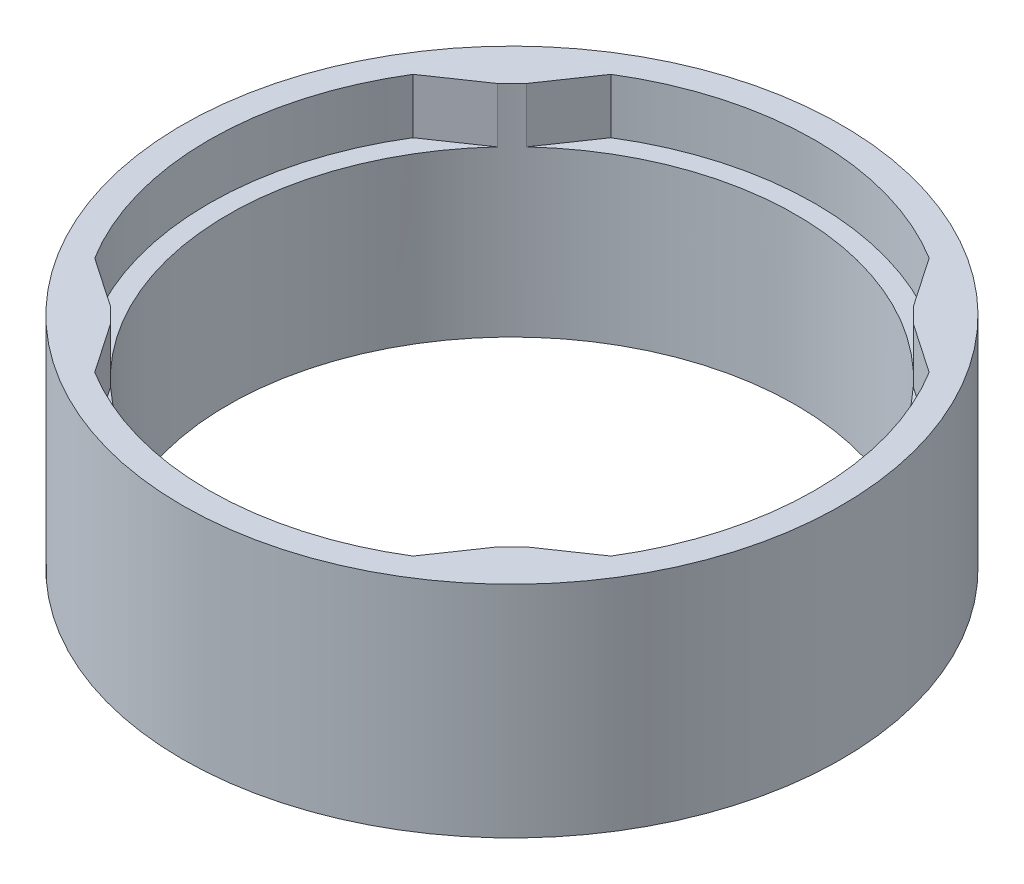
ISO-10303-21;
HEADER;
FILE_DESCRIPTION(('STEP AP214'),'2;1');
FILE_NAME('part.step','',(''),(''),'','','');
FILE_SCHEMA(('AUTOMOTIVE_DESIGN { 1 0 10303 214 1 1 1 1 }'));
ENDSEC;
DATA;
#1=APPLICATION_CONTEXT('core data for automotive mechanical design processes');
#2=APPLICATION_PROTOCOL_DEFINITION('international standard','automotive_design',2000,#1);
#3=PRODUCT_CONTEXT('',#1,'mechanical');
#4=PRODUCT('Part','Part','',(#3));
#5=PRODUCT_RELATED_PRODUCT_CATEGORY('part','',(#4));
#6=PRODUCT_DEFINITION_FORMATION('','',#4);
#7=PRODUCT_DEFINITION_CONTEXT('part definition',#1,'design');
#8=PRODUCT_DEFINITION('design','',#6,#7);
#9=PRODUCT_DEFINITION_SHAPE('','',#8);
#10=(LENGTH_UNIT() NAMED_UNIT(*) SI_UNIT(.MILLI.,.METRE.));
#11=(NAMED_UNIT(*) PLANE_ANGLE_UNIT() SI_UNIT($,.RADIAN.));
#12=(NAMED_UNIT(*) SI_UNIT($,.STERADIAN.) SOLID_ANGLE_UNIT());
#13=UNCERTAINTY_MEASURE_WITH_UNIT(LENGTH_MEASURE(1.E-05),#10,'distance_accuracy_value','');
#14=(GEOMETRIC_REPRESENTATION_CONTEXT(3) GLOBAL_UNCERTAINTY_ASSIGNED_CONTEXT((#13)) GLOBAL_UNIT_ASSIGNED_CONTEXT((#10,
#11,#12)) REPRESENTATION_CONTEXT('',''));
#15=CARTESIAN_POINT('',(0.,0.,0.));
#16=DIRECTION('',(0.,0.,1.));
#17=DIRECTION('',(1.,0.,0.));
#18=AXIS2_PLACEMENT_3D('',#15,#16,#17);
#19=CARTESIAN_POINT('',(0.,-50.8,0.));
#20=DIRECTION('',(0.,1.,0.));
#21=DIRECTION('',(0.,0.,1.));
#22=AXIS2_PLACEMENT_3D('',#19,#20,#21);
#23=CYLINDRICAL_SURFACE('',#22,76.2);
#24=CARTESIAN_POINT('',(0.,-50.8,0.));
#25=DIRECTION('',(0.,1.,0.));
#26=DIRECTION('',(0.,0.,1.));
#27=AXIS2_PLACEMENT_3D('',#24,#25,#26);
#28=CIRCLE('',#27,76.2);
#29=CARTESIAN_POINT('',(0.,-50.8,76.2));
#30=VERTEX_POINT('',#29);
#31=EDGE_CURVE('E11',#30,#30,#28,.T.);
#32=ORIENTED_EDGE('',*,*,#31,.T.);
#33=EDGE_LOOP('',(#32));
#34=FACE_BOUND('',#33,.T.);
#35=CARTESIAN_POINT('',(0.,0.,0.));
#36=DIRECTION('',(0.,1.,0.));
#37=DIRECTION('',(0.,0.,1.));
#38=AXIS2_PLACEMENT_3D('',#35,#36,#37);
#39=CIRCLE('',#38,76.2);
#40=CARTESIAN_POINT('',(0.,0.,76.2));
#41=VERTEX_POINT('',#40);
#42=EDGE_CURVE('E40',#41,#41,#39,.T.);
#43=ORIENTED_EDGE('',*,*,#42,.F.);
#44=EDGE_LOOP('',(#43));
#45=FACE_BOUND('',#44,.T.);
#46=ADVANCED_FACE('F37',(#34,#45),#23,.T.);
#47=CARTESIAN_POINT('',(0.,-50.8,0.));
#48=DIRECTION('',(0.,1.,0.));
#49=DIRECTION('',(0.,0.,1.));
#50=AXIS2_PLACEMENT_3D('',#47,#48,#49);
#51=PLANE('',#50);
#52=CARTESIAN_POINT('',(0.,-50.8,0.));
#53=DIRECTION('',(0.,1.,0.));
#54=DIRECTION('',(0.,0.,1.));
#55=AXIS2_PLACEMENT_3D('',#52,#53,#54);
#56=CIRCLE('',#55,65.659);
#57=CARTESIAN_POINT('',(0.,-50.8,65.659));
#58=VERTEX_POINT('',#57);
#59=EDGE_CURVE('E262',#58,#58,#56,.T.);
#60=ORIENTED_EDGE('',*,*,#59,.T.);
#61=EDGE_LOOP('',(#60));
#62=FACE_BOUND('',#61,.T.);
#63=ORIENTED_EDGE('',*,*,#31,.F.);
#64=EDGE_LOOP('',(#63));
#65=FACE_BOUND('',#64,.T.);
#66=ADVANCED_FACE('F339',(#62,#65),#51,.F.);
#67=CARTESIAN_POINT('',(0.,0.,0.));
#68=DIRECTION('',(0.,1.,0.));
#69=DIRECTION('',(0.,0.,1.));
#70=AXIS2_PLACEMENT_3D('',#67,#68,#69);
#71=PLANE('',#70);
#72=DIRECTION('',(0.564151653309519,0.,0.825671188832538));
#73=VECTOR('',#72,1.);
#74=CARTESIAN_POINT('',(-44.7138863771752,0.,48.0808968931432));
#75=LINE('',#74,#73);
#76=CARTESIAN_POINT('',(-44.7138863771752,0.,48.0808968931432));
#77=VERTEX_POINT('',#76);
#78=CARTESIAN_POINT('',(-36.7939263437159,0.,59.6722531853223));
#79=VERTEX_POINT('',#78);
#80=EDGE_CURVE('E177',#77,#79,#75,.T.);
#81=ORIENTED_EDGE('',*,*,#80,.F.);
#82=CARTESIAN_POINT('',(0.,0.,0.));
#83=DIRECTION('',(0.,1.,0.));
#84=DIRECTION('',(0.,0.,1.));
#85=AXIS2_PLACEMENT_3D('',#82,#83,#84);
#86=CIRCLE('',#85,65.659);
#87=CARTESIAN_POINT('',(-48.080896893143,0.,44.7138863771754));
#88=VERTEX_POINT('',#87);
#89=EDGE_CURVE('E265',#88,#77,#86,.T.);
#90=ORIENTED_EDGE('',*,*,#89,.F.);
#91=DIRECTION('',(0.82567118883254,0.,0.564151653309516));
#92=VECTOR('',#91,1.);
#93=CARTESIAN_POINT('',(-48.080896893143,0.,44.7138863771754));
#94=LINE('',#93,#92);
#95=CARTESIAN_POINT('',(-59.6722531853222,0.,36.7939263437161));
#96=VERTEX_POINT('',#95);
#97=EDGE_CURVE('E248',#96,#88,#94,.T.);
#98=ORIENTED_EDGE('',*,*,#97,.F.);
#99=CARTESIAN_POINT('',(0.,0.,0.));
#100=DIRECTION('',(0.,1.,0.));
#101=DIRECTION('',(0.,0.,-1.));
#102=AXIS2_PLACEMENT_3D('',#99,#100,#101);
#103=CIRCLE('',#102,70.104);
#104=CARTESIAN_POINT('',(-59.6722531853222,0.,-36.7939263437161));
#105=VERTEX_POINT('',#104);
#106=EDGE_CURVE('E182',#105,#96,#103,.T.);
#107=ORIENTED_EDGE('',*,*,#106,.F.);
#108=DIRECTION('',(-0.82567118883254,0.,0.564151653309516));
#109=VECTOR('',#108,1.);
#110=CARTESIAN_POINT('',(-48.080896893143,0.,-44.7138863771754));
#111=LINE('',#110,#109);
#112=CARTESIAN_POINT('',(-48.080896893143,0.,-44.7138863771754));
#113=VERTEX_POINT('',#112);
#114=EDGE_CURVE('E238',#113,#105,#111,.T.);
#115=ORIENTED_EDGE('',*,*,#114,.F.);
#116=CARTESIAN_POINT('',(-44.7138863771759,0.,-48.0808968931426));
#117=VERTEX_POINT('',#116);
#118=EDGE_CURVE('E254',#117,#113,#86,.T.);
#119=ORIENTED_EDGE('',*,*,#118,.F.);
#120=DIRECTION('',(-0.564151653309507,0.,0.825671188832546));
#121=VECTOR('',#120,1.);
#122=CARTESIAN_POINT('',(-44.7138863771759,0.,-48.0808968931426));
#123=LINE('',#122,#121);
#124=CARTESIAN_POINT('',(-36.7939263437167,0.,-59.6722531853218));
#125=VERTEX_POINT('',#124);
#126=EDGE_CURVE('E218',#125,#117,#123,.T.);
#127=ORIENTED_EDGE('',*,*,#126,.F.);
#128=CARTESIAN_POINT('',(0.,0.,0.));
#129=DIRECTION('',(0.,1.,0.));
#130=DIRECTION('',(1.,0.,0.));
#131=AXIS2_PLACEMENT_3D('',#128,#129,#130);
#132=CIRCLE('',#131,70.104);
#133=CARTESIAN_POINT('',(36.7939263437155,0.,-59.6722531853226));
#134=VERTEX_POINT('',#133);
#135=EDGE_CURVE('E225',#134,#125,#132,.T.);
#136=ORIENTED_EDGE('',*,*,#135,.F.);
#137=DIRECTION('',(-0.564151653309525,0.,-0.825671188832534));
#138=VECTOR('',#137,1.);
#139=CARTESIAN_POINT('',(44.7138863771749,0.,-48.0808968931435));
#140=LINE('',#139,#138);
#141=CARTESIAN_POINT('',(44.7138863771749,0.,-48.0808968931435));
#142=VERTEX_POINT('',#141);
#143=EDGE_CURVE('E230',#142,#134,#140,.T.);
#144=ORIENTED_EDGE('',*,*,#143,.F.);
#145=CARTESIAN_POINT('',(48.080896893143,0.,-44.7138863771754));
#146=VERTEX_POINT('',#145);
#147=EDGE_CURVE('E272',#146,#142,#86,.T.);
#148=ORIENTED_EDGE('',*,*,#147,.F.);
#149=DIRECTION('',(-0.82567118883254,0.,-0.564151653309516));
#150=VECTOR('',#149,1.);
#151=CARTESIAN_POINT('',(48.080896893143,0.,-44.7138863771754));
#152=LINE('',#151,#150);
#153=CARTESIAN_POINT('',(59.6722531853222,0.,-36.7939263437161));
#154=VERTEX_POINT('',#153);
#155=EDGE_CURVE('E193',#154,#146,#152,.T.);
#156=ORIENTED_EDGE('',*,*,#155,.F.);
#157=CARTESIAN_POINT('',(0.,0.,0.));
#158=DIRECTION('',(0.,1.,0.));
#159=DIRECTION('',(0.,0.,1.));
#160=AXIS2_PLACEMENT_3D('',#157,#158,#159);
#161=CIRCLE('',#160,70.104);
#162=CARTESIAN_POINT('',(59.6722531853222,0.,36.7939263437161));
#163=VERTEX_POINT('',#162);
#164=EDGE_CURVE('E198',#163,#154,#161,.T.);
#165=ORIENTED_EDGE('',*,*,#164,.F.);
#166=DIRECTION('',(0.82567118883254,0.,-0.564151653309516));
#167=VECTOR('',#166,1.);
#168=CARTESIAN_POINT('',(48.080896893143,0.,44.7138863771754));
#169=LINE('',#168,#167);
#170=CARTESIAN_POINT('',(48.080896893143,0.,44.7138863771754));
#171=VERTEX_POINT('',#170);
#172=EDGE_CURVE('E203',#171,#163,#169,.T.);
#173=ORIENTED_EDGE('',*,*,#172,.F.);
#174=CARTESIAN_POINT('',(44.7138863771755,0.,48.0808968931429));
#175=VERTEX_POINT('',#174);
#176=EDGE_CURVE('E267',#175,#171,#86,.T.);
#177=ORIENTED_EDGE('',*,*,#176,.F.);
#178=DIRECTION('',(0.564151653309513,0.,-0.825671188832542));
#179=VECTOR('',#178,1.);
#180=CARTESIAN_POINT('',(44.7138863771755,0.,48.0808968931429));
#181=LINE('',#180,#179);
#182=CARTESIAN_POINT('',(36.7939263437163,0.,59.672253185322));
#183=VERTEX_POINT('',#182);
#184=EDGE_CURVE('E172',#183,#175,#181,.T.);
#185=ORIENTED_EDGE('',*,*,#184,.F.);
#186=CARTESIAN_POINT('',(0.,0.,0.));
#187=DIRECTION('',(0.,1.,0.));
#188=DIRECTION('',(-1.,0.,0.));
#189=AXIS2_PLACEMENT_3D('',#186,#187,#188);
#190=CIRCLE('',#189,70.104);
#191=EDGE_CURVE('E167',#79,#183,#190,.T.);
#192=ORIENTED_EDGE('',*,*,#191,.F.);
#193=EDGE_LOOP('',(#81,#90,#98,#107,#115,#119,#127,#136,#144,#148,#156,#165,#173,#177,#185,#192));
#194=FACE_BOUND('',#193,.T.);
#195=ORIENTED_EDGE('',*,*,#42,.T.);
#196=EDGE_LOOP('',(#195));
#197=FACE_BOUND('',#196,.T.);
#198=ADVANCED_FACE('F286',(#194,#197),#71,.T.);
#199=CARTESIAN_POINT('',(0.,-50.8,0.));
#200=DIRECTION('',(0.,1.,0.));
#201=DIRECTION('',(0.,0.,1.));
#202=AXIS2_PLACEMENT_3D('',#199,#200,#201);
#203=CYLINDRICAL_SURFACE('',#202,65.659);
#204=ORIENTED_EDGE('',*,*,#89,.T.);
#205=DIRECTION('',(0.,1.,0.));
#206=VECTOR('',#205,1.);
#207=CARTESIAN_POINT('',(-44.7138863771752,-12.7,48.0808968931432));
#208=LINE('',#207,#206);
#209=CARTESIAN_POINT('',(-44.7138863771752,-12.7,48.0808968931432));
#210=VERTEX_POINT('',#209);
#211=EDGE_CURVE('E180',#210,#77,#208,.T.);
#212=ORIENTED_EDGE('',*,*,#211,.F.);
#213=CARTESIAN_POINT('',(0.,-12.7,0.));
#214=DIRECTION('',(0.,-1.,0.));
#215=DIRECTION('',(-1.,0.,0.));
#216=AXIS2_PLACEMENT_3D('',#213,#214,#215);
#217=CIRCLE('',#216,65.659);
#218=CARTESIAN_POINT('',(44.7138863771755,-12.7,48.0808968931429));
#219=VERTEX_POINT('',#218);
#220=EDGE_CURVE('E159',#219,#210,#217,.T.);
#221=ORIENTED_EDGE('',*,*,#220,.F.);
#222=DIRECTION('',(0.,1.,0.));
#223=VECTOR('',#222,1.);
#224=CARTESIAN_POINT('',(44.7138863771755,-12.7,48.0808968931429));
#225=LINE('',#224,#223);
#226=EDGE_CURVE('E51',#219,#175,#225,.T.);
#227=ORIENTED_EDGE('',*,*,#226,.T.);
#228=ORIENTED_EDGE('',*,*,#176,.T.);
#229=DIRECTION('',(0.,1.,0.));
#230=VECTOR('',#229,1.);
#231=CARTESIAN_POINT('',(48.080896893143,-12.7,44.7138863771754));
#232=LINE('',#231,#230);
#233=CARTESIAN_POINT('',(48.080896893143,-12.7,44.7138863771754));
#234=VERTEX_POINT('',#233);
#235=EDGE_CURVE('E206',#234,#171,#232,.T.);
#236=ORIENTED_EDGE('',*,*,#235,.F.);
#237=CARTESIAN_POINT('',(0.,-12.7,0.));
#238=DIRECTION('',(0.,-1.,0.));
#239=DIRECTION('',(0.,0.,1.));
#240=AXIS2_PLACEMENT_3D('',#237,#238,#239);
#241=CIRCLE('',#240,65.659);
#242=CARTESIAN_POINT('',(48.080896893143,-12.7,-44.7138863771754));
#243=VERTEX_POINT('',#242);
#244=EDGE_CURVE('E183',#243,#234,#241,.T.);
#245=ORIENTED_EDGE('',*,*,#244,.F.);
#246=DIRECTION('',(0.,1.,0.));
#247=VECTOR('',#246,1.);
#248=CARTESIAN_POINT('',(48.080896893143,-12.7,-44.7138863771754));
#249=LINE('',#248,#247);
#250=EDGE_CURVE('E59',#243,#146,#249,.T.);
#251=ORIENTED_EDGE('',*,*,#250,.T.);
#252=ORIENTED_EDGE('',*,*,#147,.T.);
#253=DIRECTION('',(0.,1.,0.));
#254=VECTOR('',#253,1.);
#255=CARTESIAN_POINT('',(44.7138863771749,-12.7,-48.0808968931435));
#256=LINE('',#255,#254);
#257=CARTESIAN_POINT('',(44.7138863771749,-12.7,-48.0808968931435));
#258=VERTEX_POINT('',#257);
#259=EDGE_CURVE('E186',#258,#142,#256,.T.);
#260=ORIENTED_EDGE('',*,*,#259,.F.);
#261=CARTESIAN_POINT('',(0.,-12.7,0.));
#262=DIRECTION('',(0.,-1.,0.));
#263=DIRECTION('',(1.,0.,0.));
#264=AXIS2_PLACEMENT_3D('',#261,#262,#263);
#265=CIRCLE('',#264,65.659);
#266=CARTESIAN_POINT('',(-44.7138863771759,-12.7,-48.0808968931426));
#267=VERTEX_POINT('',#266);
#268=EDGE_CURVE('E208',#267,#258,#265,.T.);
#269=ORIENTED_EDGE('',*,*,#268,.F.);
#270=DIRECTION('',(0.,1.,0.));
#271=VECTOR('',#270,1.);
#272=CARTESIAN_POINT('',(-44.7138863771759,-12.7,-48.0808968931426));
#273=LINE('',#272,#271);
#274=EDGE_CURVE('E220',#267,#117,#273,.T.);
#275=ORIENTED_EDGE('',*,*,#274,.T.);
#276=ORIENTED_EDGE('',*,*,#118,.T.);
#277=DIRECTION('',(0.,1.,0.));
#278=VECTOR('',#277,1.);
#279=CARTESIAN_POINT('',(-48.080896893143,-12.7,-44.7138863771754));
#280=LINE('',#279,#278);
#281=CARTESIAN_POINT('',(-48.080896893143,-12.7,-44.7138863771754));
#282=VERTEX_POINT('',#281);
#283=EDGE_CURVE('E255',#282,#113,#280,.T.);
#284=ORIENTED_EDGE('',*,*,#283,.F.);
#285=CARTESIAN_POINT('',(0.,-12.7,0.));
#286=DIRECTION('',(0.,-1.,0.));
#287=DIRECTION('',(0.,0.,-1.));
#288=AXIS2_PLACEMENT_3D('',#285,#286,#287);
#289=CIRCLE('',#288,65.659);
#290=CARTESIAN_POINT('',(-48.080896893143,-12.7,44.7138863771754));
#291=VERTEX_POINT('',#290);
#292=EDGE_CURVE('E240',#291,#282,#289,.T.);
#293=ORIENTED_EDGE('',*,*,#292,.F.);
#294=DIRECTION('',(0.,1.,0.));
#295=VECTOR('',#294,1.);
#296=CARTESIAN_POINT('',(-48.080896893143,-12.7,44.7138863771754));
#297=LINE('',#296,#295);
#298=EDGE_CURVE('E258',#291,#88,#297,.T.);
#299=ORIENTED_EDGE('',*,*,#298,.T.);
#300=EDGE_LOOP('',(#204,#212,#221,#227,#228,#236,#245,#251,#252,#260,#269,#275,#276,#284,#293,#299));
#301=FACE_BOUND('',#300,.T.);
#302=ORIENTED_EDGE('',*,*,#59,.F.);
#303=EDGE_LOOP('',(#302));
#304=FACE_BOUND('',#303,.T.);
#305=ADVANCED_FACE('F278',(#301,#304),#203,.F.);
#306=CARTESIAN_POINT('',(0.,-12.7,0.));
#307=DIRECTION('',(0.,1.,0.));
#308=DIRECTION('',(0.,0.,1.));
#309=AXIS2_PLACEMENT_3D('',#306,#307,#308);
#310=CYLINDRICAL_SURFACE('',#309,70.104);
#311=ORIENTED_EDGE('',*,*,#106,.T.);
#312=DIRECTION('',(0.,1.,0.));
#313=VECTOR('',#312,1.);
#314=CARTESIAN_POINT('',(-59.6722531853222,-12.7,36.7939263437161));
#315=LINE('',#314,#313);
#316=CARTESIAN_POINT('',(-59.6722531853222,-12.7,36.7939263437161));
#317=VERTEX_POINT('',#316);
#318=EDGE_CURVE('E245',#317,#96,#315,.T.);
#319=ORIENTED_EDGE('',*,*,#318,.F.);
#320=CARTESIAN_POINT('',(0.,-12.7,0.));
#321=DIRECTION('',(0.,1.,0.));
#322=DIRECTION('',(0.,0.,-1.));
#323=AXIS2_PLACEMENT_3D('',#320,#321,#322);
#324=CIRCLE('',#323,70.104);
#325=CARTESIAN_POINT('',(-59.6722531853222,-12.7,-36.7939263437161));
#326=VERTEX_POINT('',#325);
#327=EDGE_CURVE('E234',#326,#317,#324,.T.);
#328=ORIENTED_EDGE('',*,*,#327,.F.);
#329=DIRECTION('',(0.,1.,0.));
#330=VECTOR('',#329,1.);
#331=CARTESIAN_POINT('',(-59.6722531853222,-12.7,-36.7939263437161));
#332=LINE('',#331,#330);
#333=EDGE_CURVE('E252',#326,#105,#332,.T.);
#334=ORIENTED_EDGE('',*,*,#333,.T.);
#335=EDGE_LOOP('',(#311,#319,#328,#334));
#336=FACE_BOUND('',#335,.T.);
#337=ADVANCED_FACE('F354',(#336),#310,.F.);
#338=CARTESIAN_POINT('',(-48.080896893143,-12.7,-44.7138863771754));
#339=DIRECTION('',(-0.564151653309516,0.,-0.82567118883254));
#340=DIRECTION('',(-0.82567118883254,0.,0.564151653309516));
#341=AXIS2_PLACEMENT_3D('',#338,#339,#340);
#342=PLANE('',#341);
#343=ORIENTED_EDGE('',*,*,#114,.T.);
#344=ORIENTED_EDGE('',*,*,#333,.F.);
#345=DIRECTION('',(-0.82567118883254,0.,0.564151653309516));
#346=VECTOR('',#345,1.);
#347=CARTESIAN_POINT('',(-48.080896893143,-12.7,-44.7138863771754));
#348=LINE('',#347,#346);
#349=EDGE_CURVE('E242',#282,#326,#348,.T.);
#350=ORIENTED_EDGE('',*,*,#349,.F.);
#351=ORIENTED_EDGE('',*,*,#283,.T.);
#352=EDGE_LOOP('',(#343,#344,#350,#351));
#353=FACE_BOUND('',#352,.T.);
#354=ADVANCED_FACE('F303',(#353),#342,.F.);
#355=CARTESIAN_POINT('',(-48.080896893143,-12.7,44.7138863771754));
#356=DIRECTION('',(-0.564151653309516,0.,0.82567118883254));
#357=DIRECTION('',(0.82567118883254,0.,0.564151653309516));
#358=AXIS2_PLACEMENT_3D('',#355,#356,#357);
#359=PLANE('',#358);
#360=ORIENTED_EDGE('',*,*,#97,.T.);
#361=ORIENTED_EDGE('',*,*,#298,.F.);
#362=DIRECTION('',(0.82567118883254,0.,0.564151653309516));
#363=VECTOR('',#362,1.);
#364=CARTESIAN_POINT('',(-48.080896893143,-12.7,44.7138863771754));
#365=LINE('',#364,#363);
#366=EDGE_CURVE('E237',#317,#291,#365,.T.);
#367=ORIENTED_EDGE('',*,*,#366,.F.);
#368=ORIENTED_EDGE('',*,*,#318,.T.);
#369=EDGE_LOOP('',(#360,#361,#367,#368));
#370=FACE_BOUND('',#369,.T.);
#371=ADVANCED_FACE('F312',(#370),#359,.F.);
#372=CARTESIAN_POINT('',(0.,-12.7,0.));
#373=DIRECTION('',(0.,-1.,0.));
#374=DIRECTION('',(0.,0.,-1.));
#375=AXIS2_PLACEMENT_3D('',#372,#373,#374);
#376=PLANE('',#375);
#377=ORIENTED_EDGE('',*,*,#327,.T.);
#378=ORIENTED_EDGE('',*,*,#366,.T.);
#379=ORIENTED_EDGE('',*,*,#292,.T.);
#380=ORIENTED_EDGE('',*,*,#349,.T.);
#381=EDGE_LOOP('',(#377,#378,#379,#380));
#382=FACE_BOUND('',#381,.T.);
#383=ADVANCED_FACE('F309',(#382),#376,.F.);
#384=CARTESIAN_POINT('',(44.7138863771749,-12.7,-48.0808968931435));
#385=DIRECTION('',(0.825671188832534,0.,-0.564151653309525));
#386=DIRECTION('',(-0.564151653309525,0.,-0.825671188832534));
#387=AXIS2_PLACEMENT_3D('',#384,#385,#386);
#388=PLANE('',#387);
#389=ORIENTED_EDGE('',*,*,#143,.T.);
#390=DIRECTION('',(0.,1.,0.));
#391=VECTOR('',#390,1.);
#392=CARTESIAN_POINT('',(36.7939263437155,-12.7,-59.6722531853226));
#393=LINE('',#392,#391);
#394=CARTESIAN_POINT('',(36.7939263437155,-12.7,-59.6722531853226));
#395=VERTEX_POINT('',#394);
#396=EDGE_CURVE('E228',#395,#134,#393,.T.);
#397=ORIENTED_EDGE('',*,*,#396,.F.);
#398=DIRECTION('',(-0.564151653309525,0.,-0.825671188832534));
#399=VECTOR('',#398,1.);
#400=CARTESIAN_POINT('',(44.7138863771749,-12.7,-48.0808968931435));
#401=LINE('',#400,#399);
#402=EDGE_CURVE('E215',#258,#395,#401,.T.);
#403=ORIENTED_EDGE('',*,*,#402,.F.);
#404=ORIENTED_EDGE('',*,*,#259,.T.);
#405=EDGE_LOOP('',(#389,#397,#403,#404));
#406=FACE_BOUND('',#405,.T.);
#407=ADVANCED_FACE('F293',(#406),#388,.F.);
#408=CARTESIAN_POINT('',(0.,-12.7,0.));
#409=DIRECTION('',(0.,1.,0.));
#410=DIRECTION('',(-1.,0.,0.));
#411=AXIS2_PLACEMENT_3D('',#408,#409,#410);
#412=CYLINDRICAL_SURFACE('',#411,70.104);
#413=ORIENTED_EDGE('',*,*,#135,.T.);
#414=DIRECTION('',(0.,1.,0.));
#415=VECTOR('',#414,1.);
#416=CARTESIAN_POINT('',(-36.7939263437167,-12.7,-59.6722531853218));
#417=LINE('',#416,#415);
#418=CARTESIAN_POINT('',(-36.7939263437167,-12.7,-59.6722531853218));
#419=VERTEX_POINT('',#418);
#420=EDGE_CURVE('E223',#419,#125,#417,.T.);
#421=ORIENTED_EDGE('',*,*,#420,.F.);
#422=CARTESIAN_POINT('',(0.,-12.7,0.));
#423=DIRECTION('',(0.,1.,0.));
#424=DIRECTION('',(1.,0.,0.));
#425=AXIS2_PLACEMENT_3D('',#422,#423,#424);
#426=CIRCLE('',#425,70.104);
#427=EDGE_CURVE('E210',#395,#419,#426,.T.);
#428=ORIENTED_EDGE('',*,*,#427,.F.);
#429=ORIENTED_EDGE('',*,*,#396,.T.);
#430=EDGE_LOOP('',(#413,#421,#428,#429));
#431=FACE_BOUND('',#430,.T.);
#432=ADVANCED_FACE('F368',(#431),#412,.F.);
#433=CARTESIAN_POINT('',(-44.7138863771759,-12.7,-48.0808968931426));
#434=DIRECTION('',(-0.825671188832546,0.,-0.564151653309507));
#435=DIRECTION('',(-0.564151653309507,0.,0.825671188832546));
#436=AXIS2_PLACEMENT_3D('',#433,#434,#435);
#437=PLANE('',#436);
#438=ORIENTED_EDGE('',*,*,#126,.T.);
#439=ORIENTED_EDGE('',*,*,#274,.F.);
#440=DIRECTION('',(-0.564151653309507,0.,0.825671188832546));
#441=VECTOR('',#440,1.);
#442=CARTESIAN_POINT('',(-44.7138863771759,-12.7,-48.0808968931426));
#443=LINE('',#442,#441);
#444=EDGE_CURVE('E212',#419,#267,#443,.T.);
#445=ORIENTED_EDGE('',*,*,#444,.F.);
#446=ORIENTED_EDGE('',*,*,#420,.T.);
#447=EDGE_LOOP('',(#438,#439,#445,#446));
#448=FACE_BOUND('',#447,.T.);
#449=ADVANCED_FACE('F371',(#448),#437,.F.);
#450=CARTESIAN_POINT('',(0.,-12.7,0.));
#451=DIRECTION('',(0.,-1.,0.));
#452=DIRECTION('',(1.,0.,0.));
#453=AXIS2_PLACEMENT_3D('',#450,#451,#452);
#454=PLANE('',#453);
#455=ORIENTED_EDGE('',*,*,#427,.T.);
#456=ORIENTED_EDGE('',*,*,#444,.T.);
#457=ORIENTED_EDGE('',*,*,#268,.T.);
#458=ORIENTED_EDGE('',*,*,#402,.T.);
#459=EDGE_LOOP('',(#455,#456,#457,#458));
#460=FACE_BOUND('',#459,.T.);
#461=ADVANCED_FACE('F296',(#460),#454,.F.);
#462=CARTESIAN_POINT('',(48.080896893143,-12.7,44.7138863771754));
#463=DIRECTION('',(0.564151653309516,0.,0.82567118883254));
#464=DIRECTION('',(0.82567118883254,0.,-0.564151653309516));
#465=AXIS2_PLACEMENT_3D('',#462,#463,#464);
#466=PLANE('',#465);
#467=ORIENTED_EDGE('',*,*,#172,.T.);
#468=DIRECTION('',(0.,1.,0.));
#469=VECTOR('',#468,1.);
#470=CARTESIAN_POINT('',(59.6722531853222,-12.7,36.7939263437161));
#471=LINE('',#470,#469);
#472=CARTESIAN_POINT('',(59.6722531853222,-12.7,36.7939263437161));
#473=VERTEX_POINT('',#472);
#474=EDGE_CURVE('E201',#473,#163,#471,.T.);
#475=ORIENTED_EDGE('',*,*,#474,.F.);
#476=DIRECTION('',(0.82567118883254,0.,-0.564151653309516));
#477=VECTOR('',#476,1.);
#478=CARTESIAN_POINT('',(48.080896893143,-12.7,44.7138863771754));
#479=LINE('',#478,#477);
#480=EDGE_CURVE('E190',#234,#473,#479,.T.);
#481=ORIENTED_EDGE('',*,*,#480,.F.);
#482=ORIENTED_EDGE('',*,*,#235,.T.);
#483=EDGE_LOOP('',(#467,#475,#481,#482));
#484=FACE_BOUND('',#483,.T.);
#485=ADVANCED_FACE('F322',(#484),#466,.F.);
#486=CARTESIAN_POINT('',(0.,-12.7,0.));
#487=DIRECTION('',(0.,1.,0.));
#488=DIRECTION('',(0.,0.,-1.));
#489=AXIS2_PLACEMENT_3D('',#486,#487,#488);
#490=CYLINDRICAL_SURFACE('',#489,70.104);
#491=ORIENTED_EDGE('',*,*,#164,.T.);
#492=DIRECTION('',(0.,1.,0.));
#493=VECTOR('',#492,1.);
#494=CARTESIAN_POINT('',(59.6722531853222,-12.7,-36.7939263437161));
#495=LINE('',#494,#493);
#496=CARTESIAN_POINT('',(59.6722531853222,-12.7,-36.7939263437161));
#497=VERTEX_POINT('',#496);
#498=EDGE_CURVE('E196',#497,#154,#495,.T.);
#499=ORIENTED_EDGE('',*,*,#498,.F.);
#500=CARTESIAN_POINT('',(0.,-12.7,0.));
#501=DIRECTION('',(0.,1.,0.));
#502=DIRECTION('',(0.,0.,1.));
#503=AXIS2_PLACEMENT_3D('',#500,#501,#502);
#504=CIRCLE('',#503,70.104);
#505=EDGE_CURVE('E185',#473,#497,#504,.T.);
#506=ORIENTED_EDGE('',*,*,#505,.F.);
#507=ORIENTED_EDGE('',*,*,#474,.T.);
#508=EDGE_LOOP('',(#491,#499,#506,#507));
#509=FACE_BOUND('',#508,.T.);
#510=ADVANCED_FACE('F329',(#509),#490,.F.);
#511=CARTESIAN_POINT('',(48.080896893143,-12.7,-44.7138863771754));
#512=DIRECTION('',(0.564151653309516,0.,-0.82567118883254));
#513=DIRECTION('',(-0.82567118883254,0.,-0.564151653309516));
#514=AXIS2_PLACEMENT_3D('',#511,#512,#513);
#515=PLANE('',#514);
#516=ORIENTED_EDGE('',*,*,#155,.T.);
#517=ORIENTED_EDGE('',*,*,#250,.F.);
#518=DIRECTION('',(-0.82567118883254,0.,-0.564151653309516));
#519=VECTOR('',#518,1.);
#520=CARTESIAN_POINT('',(48.080896893143,-12.7,-44.7138863771754));
#521=LINE('',#520,#519);
#522=EDGE_CURVE('E188',#497,#243,#521,.T.);
#523=ORIENTED_EDGE('',*,*,#522,.F.);
#524=ORIENTED_EDGE('',*,*,#498,.T.);
#525=EDGE_LOOP('',(#516,#517,#523,#524));
#526=FACE_BOUND('',#525,.T.);
#527=ADVANCED_FACE('F327',(#526),#515,.F.);
#528=CARTESIAN_POINT('',(0.,-12.7,0.));
#529=DIRECTION('',(0.,-1.,0.));
#530=DIRECTION('',(0.,0.,1.));
#531=AXIS2_PLACEMENT_3D('',#528,#529,#530);
#532=PLANE('',#531);
#533=ORIENTED_EDGE('',*,*,#505,.T.);
#534=ORIENTED_EDGE('',*,*,#522,.T.);
#535=ORIENTED_EDGE('',*,*,#244,.T.);
#536=ORIENTED_EDGE('',*,*,#480,.T.);
#537=EDGE_LOOP('',(#533,#534,#535,#536));
#538=FACE_BOUND('',#537,.T.);
#539=ADVANCED_FACE('F325',(#538),#532,.F.);
#540=CARTESIAN_POINT('',(-44.7138863771752,-12.7,48.0808968931432));
#541=DIRECTION('',(-0.825671188832538,0.,0.564151653309519));
#542=DIRECTION('',(0.564151653309519,0.,0.825671188832538));
#543=AXIS2_PLACEMENT_3D('',#540,#541,#542);
#544=PLANE('',#543);
#545=ORIENTED_EDGE('',*,*,#80,.T.);
#546=DIRECTION('',(0.,1.,0.));
#547=VECTOR('',#546,1.);
#548=CARTESIAN_POINT('',(-36.7939263437159,-12.7,59.6722531853223));
#549=LINE('',#548,#547);
#550=CARTESIAN_POINT('',(-36.7939263437159,-12.7,59.6722531853223));
#551=VERTEX_POINT('',#550);
#552=EDGE_CURVE('E170',#551,#79,#549,.T.);
#553=ORIENTED_EDGE('',*,*,#552,.F.);
#554=DIRECTION('',(0.564151653309519,0.,0.825671188832538));
#555=VECTOR('',#554,1.);
#556=CARTESIAN_POINT('',(-44.7138863771752,-12.7,48.0808968931432));
#557=LINE('',#556,#555);
#558=EDGE_CURVE('E155',#210,#551,#557,.T.);
#559=ORIENTED_EDGE('',*,*,#558,.F.);
#560=ORIENTED_EDGE('',*,*,#211,.T.);
#561=EDGE_LOOP('',(#545,#553,#559,#560));
#562=FACE_BOUND('',#561,.T.);
#563=ADVANCED_FACE('F314',(#562),#544,.F.);
#564=CARTESIAN_POINT('',(0.,-12.7,0.));
#565=DIRECTION('',(0.,1.,0.));
#566=DIRECTION('',(1.,0.,0.));
#567=AXIS2_PLACEMENT_3D('',#564,#565,#566);
#568=CYLINDRICAL_SURFACE('',#567,70.104);
#569=ORIENTED_EDGE('',*,*,#191,.T.);
#570=DIRECTION('',(0.,1.,0.));
#571=VECTOR('',#570,1.);
#572=CARTESIAN_POINT('',(36.7939263437163,-12.7,59.672253185322));
#573=LINE('',#572,#571);
#574=CARTESIAN_POINT('',(36.7939263437163,-12.7,59.672253185322));
#575=VERTEX_POINT('',#574);
#576=EDGE_CURVE('E162',#575,#183,#573,.T.);
#577=ORIENTED_EDGE('',*,*,#576,.F.);
#578=CARTESIAN_POINT('',(0.,-12.7,0.));
#579=DIRECTION('',(0.,1.,0.));
#580=DIRECTION('',(-1.,0.,0.));
#581=AXIS2_PLACEMENT_3D('',#578,#579,#580);
#582=CIRCLE('',#581,70.104);
#583=EDGE_CURVE('E150',#551,#575,#582,.T.);
#584=ORIENTED_EDGE('',*,*,#583,.F.);
#585=ORIENTED_EDGE('',*,*,#552,.T.);
#586=EDGE_LOOP('',(#569,#577,#584,#585));
#587=FACE_BOUND('',#586,.T.);
#588=ADVANCED_FACE('F165',(#587),#568,.F.);
#589=CARTESIAN_POINT('',(44.7138863771755,-12.7,48.0808968931429));
#590=DIRECTION('',(0.825671188832542,0.,0.564151653309513));
#591=DIRECTION('',(0.564151653309513,0.,-0.825671188832542));
#592=AXIS2_PLACEMENT_3D('',#589,#590,#591);
#593=PLANE('',#592);
#594=ORIENTED_EDGE('',*,*,#184,.T.);
#595=ORIENTED_EDGE('',*,*,#226,.F.);
#596=DIRECTION('',(0.564151653309513,0.,-0.825671188832542));
#597=VECTOR('',#596,1.);
#598=CARTESIAN_POINT('',(44.7138863771755,-12.7,48.0808968931429));
#599=LINE('',#598,#597);
#600=EDGE_CURVE('E152',#575,#219,#599,.T.);
#601=ORIENTED_EDGE('',*,*,#600,.F.);
#602=ORIENTED_EDGE('',*,*,#576,.T.);
#603=EDGE_LOOP('',(#594,#595,#601,#602));
#604=FACE_BOUND('',#603,.T.);
#605=ADVANCED_FACE('F161',(#604),#593,.F.);
#606=CARTESIAN_POINT('',(0.,-12.7,0.));
#607=DIRECTION('',(0.,-1.,0.));
#608=DIRECTION('',(-1.,0.,0.));
#609=AXIS2_PLACEMENT_3D('',#606,#607,#608);
#610=PLANE('',#609);
#611=ORIENTED_EDGE('',*,*,#583,.T.);
#612=ORIENTED_EDGE('',*,*,#600,.T.);
#613=ORIENTED_EDGE('',*,*,#220,.T.);
#614=ORIENTED_EDGE('',*,*,#558,.T.);
#615=EDGE_LOOP('',(#611,#612,#613,#614));
#616=FACE_BOUND('',#615,.T.);
#617=ADVANCED_FACE('F151',(#616),#610,.F.);
#618=CLOSED_SHELL('',(#46,#66,#198,#305,#337,#354,#371,#383,#407,#432,#449,#461,#485,#510,#527,
#539,#563,#588,#605,#617));
#619=MANIFOLD_SOLID_BREP('B2',#618);
#620=ADVANCED_BREP_SHAPE_REPRESENTATION('',(#18,#619),#14);
#621=SHAPE_DEFINITION_REPRESENTATION(#9,#620);
ENDSEC;
END-ISO-10303-21;
